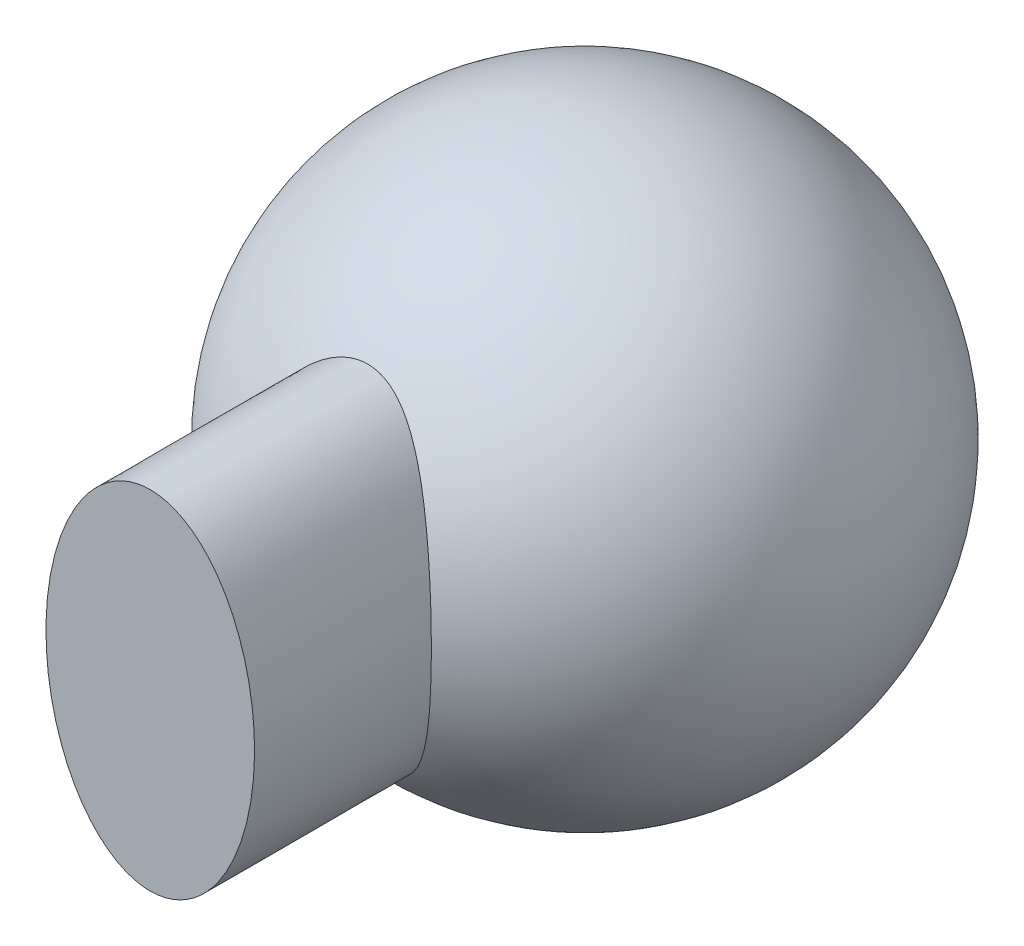
ISO-10303-21;
HEADER;
FILE_DESCRIPTION(('STEP AP214'),'2;1');
FILE_NAME('part.step','',(''),(''),'','','');
FILE_SCHEMA(('AUTOMOTIVE_DESIGN { 1 0 10303 214 1 1 1 1 }'));
ENDSEC;
DATA;
#1=APPLICATION_CONTEXT('core data for automotive mechanical design processes');
#2=APPLICATION_PROTOCOL_DEFINITION('international standard','automotive_design',2000,#1);
#3=PRODUCT_CONTEXT('',#1,'mechanical');
#4=PRODUCT('Part','Part','',(#3));
#5=PRODUCT_RELATED_PRODUCT_CATEGORY('part','',(#4));
#6=PRODUCT_DEFINITION_FORMATION('','',#4);
#7=PRODUCT_DEFINITION_CONTEXT('part definition',#1,'design');
#8=PRODUCT_DEFINITION('design','',#6,#7);
#9=PRODUCT_DEFINITION_SHAPE('','',#8);
#10=(LENGTH_UNIT() NAMED_UNIT(*) SI_UNIT(.MILLI.,.METRE.));
#11=(NAMED_UNIT(*) PLANE_ANGLE_UNIT() SI_UNIT($,.RADIAN.));
#12=(NAMED_UNIT(*) SI_UNIT($,.STERADIAN.) SOLID_ANGLE_UNIT());
#13=UNCERTAINTY_MEASURE_WITH_UNIT(LENGTH_MEASURE(1.E-05),#10,'distance_accuracy_value','');
#14=(GEOMETRIC_REPRESENTATION_CONTEXT(3) GLOBAL_UNCERTAINTY_ASSIGNED_CONTEXT((#13)) GLOBAL_UNIT_ASSIGNED_CONTEXT((#10,
#11,#12)) REPRESENTATION_CONTEXT('',''));
#15=CARTESIAN_POINT('',(0.,0.,0.));
#16=DIRECTION('',(0.,0.,1.));
#17=DIRECTION('',(1.,0.,0.));
#18=AXIS2_PLACEMENT_3D('',#15,#16,#17);
#19=CARTESIAN_POINT('',(0.,0.,19.84375));
#20=DIRECTION('',(0.,0.,1.));
#21=DIRECTION('',(0.,-1.,0.));
#22=AXIS2_PLACEMENT_3D('',#19,#20,#21);
#23=ELLIPSE('',#22,7.9375,4.7625);
#24=DIRECTION('',(0.,0.,-1.));
#25=VECTOR('',#24,1.);
#26=SURFACE_OF_LINEAR_EXTRUSION('',#23,#25);
#27=CARTESIAN_POINT('',(0.,-7.9375,9.91393432245746));
#28=CARTESIAN_POINT('',(-0.0788271013535129,-7.93749939305309,9.91393473412998));
#29=CARTESIAN_POINT('',(-0.157660724959963,-7.93423018182998,9.91561130271447));
#30=CARTESIAN_POINT('',(-0.314684303138368,-7.92123813340423,9.92225689652768));
#31=CARTESIAN_POINT('',(-0.392873930252473,-7.91151219622446,9.92722750327466));
#32=CARTESIAN_POINT('',(-0.547108536920799,-7.88599628406234,9.94021217946963));
#33=CARTESIAN_POINT('',(-0.623167628856981,-7.87027392914492,9.94819230055361));
#34=CARTESIAN_POINT('',(-0.773542638782759,-7.83312498063421,9.9669392108722));
#35=CARTESIAN_POINT('',(-0.847857833356806,-7.81169606378065,9.97770713502977));
#36=CARTESIAN_POINT('',(-1.06783476654783,-7.7394133760856,10.0137717045932));
#37=CARTESIAN_POINT('',(-1.21030495094333,-7.68060248221051,10.0428089036473));
#38=CARTESIAN_POINT('',(-1.54726343172525,-7.51494937796682,10.1229055755407));
#39=CARTESIAN_POINT('',(-1.73598879628897,-7.3984237735311,10.1779773553932));
#40=CARTESIAN_POINT('',(-2.00212622143167,-7.20384219448494,10.2664116642236));
#41=CARTESIAN_POINT('',(-2.08810391167954,-7.13559163498631,10.2968998346285));
#42=CARTESIAN_POINT('',(-2.25468831540992,-6.99335625747456,10.3591643388172));
#43=CARTESIAN_POINT('',(-2.33529603089741,-6.91937251484369,10.3909404304928));
#44=CARTESIAN_POINT('',(-2.53682775972689,-6.72194870099306,10.4738903499377));
#45=CARTESIAN_POINT('',(-2.65389862842513,-6.59479433997214,10.5255859097498));
#46=CARTESIAN_POINT('',(-2.87605598622511,-6.33076464307304,10.6288350686593));
#47=CARTESIAN_POINT('',(-2.98115652503119,-6.19390101589774,10.6803887634089));
#48=CARTESIAN_POINT('',(-3.20947387279228,-5.87110442708068,10.7969122412572));
#49=CARTESIAN_POINT('',(-3.32909047084653,-5.68246219145526,10.8614312611221));
#50=CARTESIAN_POINT('',(-3.55197522256664,-5.29435174576013,10.9862343068103));
#51=CARTESIAN_POINT('',(-3.65523271291553,-5.09487658729803,11.0465155562159));
#52=CARTESIAN_POINT('',(-3.84642079359177,-4.68759352859872,11.1613315539746));
#53=CARTESIAN_POINT('',(-3.93437703061895,-4.47980030396229,11.2158758562339));
#54=CARTESIAN_POINT('',(-4.09608842507793,-4.05725122448623,11.3183287173818));
#55=CARTESIAN_POINT('',(-4.16984657411839,-3.84249684756313,11.3662386735621));
#56=CARTESIAN_POINT('',(-4.30383825680392,-3.40746299814802,11.4546891698553));
#57=CARTESIAN_POINT('',(-4.36407851621658,-3.18718633416882,11.4952333728463));
#58=CARTESIAN_POINT('',(-4.4715804749601,-2.74220261492957,11.568449699945));
#59=CARTESIAN_POINT('',(-4.51884162917925,-2.51749537401362,11.6011214934111));
#60=CARTESIAN_POINT('',(-4.60071912447829,-2.06484896308331,11.658193458756));
#61=CARTESIAN_POINT('',(-4.63534033569729,-1.83691107307013,11.6825968161818));
#62=CARTESIAN_POINT('',(-4.69220851621079,-1.37870076429045,11.7228870055865));
#63=CARTESIAN_POINT('',(-4.71445263435496,-1.14842782005662,11.7387718752415));
#64=CARTESIAN_POINT('',(-4.74669587519764,-0.68664247924534,11.7618490927025));
#65=CARTESIAN_POINT('',(-4.75669750975929,-0.455130346713433,11.7690432236351));
#66=CARTESIAN_POINT('',(-4.76452710492962,0.00820617764960818,11.7746722992924));
#67=CARTESIAN_POINT('',(-4.7623550323927,0.240030570329222,11.7731072201681));
#68=CARTESIAN_POINT('',(-4.74582247971294,0.703051549770778,11.7612327220086));
#69=CARTESIAN_POINT('',(-4.73146039444439,0.934248049832531,11.7509221514068));
#70=CARTESIAN_POINT('',(-4.69045898457885,1.39495079661604,11.7216633038144));
#71=CARTESIAN_POINT('',(-4.66382238842379,1.6244574074624,11.7027169464415));
#72=CARTESIAN_POINT('',(-4.59808809922057,2.08088375269606,11.6563810885626));
#73=CARTESIAN_POINT('',(-4.55898723257359,2.30780281299469,11.6289894378106));
#74=CARTESIAN_POINT('',(-4.46804978724304,2.75793932931822,11.5660716569667));
#75=CARTESIAN_POINT('',(-4.41621318762835,2.98115677925889,11.5305455135058));
#76=CARTESIAN_POINT('',(-4.29938442369564,3.42283140560263,11.4517801654059));
#77=CARTESIAN_POINT('',(-4.23438776119521,3.64128692599557,11.4085383241005));
#78=CARTESIAN_POINT('',(-4.09068888384063,4.07210760243689,11.3149438849024));
#79=CARTESIAN_POINT('',(-4.01198636248485,4.28447262216079,11.2645911279944));
#80=CARTESIAN_POINT('',(-3.84004392378339,4.70182024355113,11.1575443848452));
#81=CARTESIAN_POINT('',(-3.74679226086621,4.90679671437375,11.1008452857238));
#82=CARTESIAN_POINT('',(-3.54474437414306,5.30745238800261,10.9822389366736));
#83=CARTESIAN_POINT('',(-3.43594757779432,5.5031312480147,10.9203314949509));
#84=CARTESIAN_POINT('',(-3.2251363223459,5.84449215961342,10.8057724475526));
#85=CARTESIAN_POINT('',(-3.12619012276718,5.99228990922115,10.7537767880283));
#86=CARTESIAN_POINT('',(-2.91670302100292,6.2788446322726,10.648622600598));
#87=CARTESIAN_POINT('',(-2.80617337043878,6.41761017058406,10.5954652401279));
#88=CARTESIAN_POINT('',(-2.59902944772443,6.65382287687148,10.5015294782161));
#89=CARTESIAN_POINT('',(-2.50497225563098,6.75348665321523,10.46068681265));
#90=CARTESIAN_POINT('',(-2.30853260265671,6.94523551299954,10.3800229167656));
#91=CARTESIAN_POINT('',(-2.20613350665162,7.03730467789853,10.3402039465814));
#92=CARTESIAN_POINT('',(-2.01414727692478,7.19445031512042,10.2706476375617));
#93=CARTESIAN_POINT('',(-1.92611315736618,7.26123573921094,10.2404907781185));
#94=CARTESIAN_POINT('',(-1.74433271355236,7.38775475576258,10.1824106952534));
#95=CARTESIAN_POINT('',(-1.65058464815131,7.44748618228666,10.1544881587267));
#96=CARTESIAN_POINT('',(-1.45762344605667,7.55850035437991,10.1018543187044));
#97=CARTESIAN_POINT('',(-1.3584232524695,7.60980204605636,10.0771358411553));
#98=CARTESIAN_POINT('',(-1.15467540991781,7.70268016638467,10.0318726783303));
#99=CARTESIAN_POINT('',(-1.05013167403783,7.74426359083064,10.0113249920771));
#100=CARTESIAN_POINT('',(-0.873510960910133,7.80374878403274,9.9816856019121));
#101=CARTESIAN_POINT('',(-0.802755908899298,7.82486108376775,9.97109279035284));
#102=CARTESIAN_POINT('',(-0.659591420435303,7.86193142273762,9.95241295415753));
#103=CARTESIAN_POINT('',(-0.587182481045582,7.87789098931923,9.94432518701802));
#104=CARTESIAN_POINT('',(-0.441177975160888,7.90431592017841,9.9308960656105));
#105=CARTESIAN_POINT('',(-0.367583489791073,7.91478602714362,9.92555234067518));
#106=CARTESIAN_POINT('',(-0.219646920935581,7.93001556032705,9.9177695359867));
#107=CARTESIAN_POINT('',(-0.145304817755563,7.93477483570656,9.91533053295522));
#108=CARTESIAN_POINT('',(0.00373528103012565,7.93847161993563,9.91343657582343));
#109=CARTESIAN_POINT('',(0.0784337020846186,7.93739563875154,9.91398853627497));
#110=CARTESIAN_POINT('',(0.2274325539093,7.9294172836682,9.91807372464476));
#111=CARTESIAN_POINT('',(0.301732992673467,7.92251502724204,9.92160689245399));
#112=CARTESIAN_POINT('',(0.449432285789927,7.90304233756981,9.93154109014083));
#113=CARTESIAN_POINT('',(0.52283060012773,7.89046866439472,9.93794375927459));
#114=CARTESIAN_POINT('',(0.668215064680717,7.8599312622595,9.95341899898057));
#115=CARTESIAN_POINT('',(0.740200908612164,7.84196637772042,9.96249214194737));
#116=CARTESIAN_POINT('',(0.898463295831819,7.79636521620292,9.98538112822599));
#117=CARTESIAN_POINT('',(0.984287997039687,7.76746037331058,9.99980556964539));
#118=CARTESIAN_POINT('',(1.15271268481484,7.70283850793288,10.0317465574185));
#119=CARTESIAN_POINT('',(1.23531192969671,7.66711992963,10.0492638099026));
#120=CARTESIAN_POINT('',(1.47808335787528,7.55076053678616,10.1056851331913));
#121=CARTESIAN_POINT('',(1.63305014258907,7.46097030104384,10.1484308568614));
#122=CARTESIAN_POINT('',(1.89162401924568,7.28726987072631,10.2287154587594));
#123=CARTESIAN_POINT('',(1.9984626126685,7.2073852788682,10.2649325703333));
#124=CARTESIAN_POINT('',(2.20421134365836,7.03877956584885,10.3395407016619));
#125=CARTESIAN_POINT('',(2.3031170079644,6.95005352147741,10.3779329274003));
#126=CARTESIAN_POINT('',(2.49342108488979,6.76519016254414,10.4558212483157));
#127=CARTESIAN_POINT('',(2.58481164125012,6.66904529082397,10.4953184422543));
#128=CARTESIAN_POINT('',(2.76043182478113,6.47058912111415,10.5745268304224));
#129=CARTESIAN_POINT('',(2.84466311884697,6.36827926805344,10.6142379725359));
#130=CARTESIAN_POINT('',(3.05295092242441,6.09803786949131,10.7159139772374));
#131=CARTESIAN_POINT('',(3.17208392887683,5.92617636083623,10.7775558916957));
#132=CARTESIAN_POINT('',(3.39514513279735,5.57226888687692,10.8977124882492));
#133=CARTESIAN_POINT('',(3.49909260619557,5.39023624564572,10.9562310739938));
#134=CARTESIAN_POINT('',(3.69307052646564,5.0178821819833,11.0688423727738));
#135=CARTESIAN_POINT('',(3.78311559708366,4.8275697429046,11.1229397078688));
#136=CARTESIAN_POINT('',(3.95034413099329,4.43994005594057,11.2258155767223));
#137=CARTESIAN_POINT('',(4.0275237116374,4.24262071517225,11.274592503317));
#138=CARTESIAN_POINT('',(4.16962007068551,3.84242357587747,11.3660544099245));
#139=CARTESIAN_POINT('',(4.23454577710108,3.63954994849931,11.408743819635));
#140=CARTESIAN_POINT('',(4.35270650387042,3.2292044395069,11.487529052159));
#141=CARTESIAN_POINT('',(4.40594259313807,3.02173298023604,11.5236254777928));
#142=CARTESIAN_POINT('',(4.5010916347226,2.60320313486951,11.5888134886555));
#143=CARTESIAN_POINT('',(4.54300853668094,2.39214602732019,11.6179075168679));
#144=CARTESIAN_POINT('',(4.61581546214788,1.96725249091747,11.6688180480529));
#145=CARTESIAN_POINT('',(4.64670296470262,1.75341543822179,11.6906328871704));
#146=CARTESIAN_POINT('',(4.72308196130013,1.10918093827294,11.7448000821613));
#147=CARTESIAN_POINT('',(4.75235584004921,0.675765380653234,11.7659213436404));
#148=CARTESIAN_POINT('',(4.76822477404279,-0.192231597991191,11.7773311897605));
#149=CARTESIAN_POINT('',(4.75482081401513,-0.626812991884798,11.7676204858034));
#150=CARTESIAN_POINT('',(4.70251382892573,-1.27460140129378,11.7302581066043));
#151=CARTESIAN_POINT('',(4.67969928324044,-1.48991622506651,11.7139960329266));
#152=CARTESIAN_POINT('',(4.62318391904588,-1.91840248925205,11.6740292723805));
#153=CARTESIAN_POINT('',(4.58948530638791,-2.13157435495483,11.6503260936127));
#154=CARTESIAN_POINT('',(4.51098828956948,-2.55499194675845,11.5956945688432));
#155=CARTESIAN_POINT('',(4.46618659445648,-2.76523678573965,11.5647640808234));
#156=CARTESIAN_POINT('',(4.36519541170912,-3.18182524827514,11.4960066137004));
#157=CARTESIAN_POINT('',(4.3090065471192,-3.38816908459621,11.4581800119268));
#158=CARTESIAN_POINT('',(4.18481693137413,-3.79603189145863,11.376053477634));
#159=CARTESIAN_POINT('',(4.11681291569148,-3.99754951095989,11.3317517565771));
#160=CARTESIAN_POINT('',(3.96843593536461,-4.39463865874599,11.2372519596207));
#161=CARTESIAN_POINT('',(3.88805989958492,-4.5902086961737,11.1870524204265));
#162=CARTESIAN_POINT('',(3.71411953543524,-4.97426446671298,11.0814841507833));
#163=CARTESIAN_POINT('',(3.62054000591635,-5.16274171256244,11.0261094873916));
#164=CARTESIAN_POINT('',(3.4193678285946,-5.53062625845837,10.9113374739277));
#165=CARTESIAN_POINT('',(3.31178725193776,-5.71004118880905,10.8519436099851));
#166=CARTESIAN_POINT('',(3.10272028599408,-6.02553563285262,10.7418506848741));
#167=CARTESIAN_POINT('',(3.00381302755762,-6.16347484031843,10.6915855448858));
#168=CARTESIAN_POINT('',(2.79472876844718,-6.43089539275603,10.5903023310013));
#169=CARTESIAN_POINT('',(2.68452595974259,-6.56035620921533,10.539282771506));
#170=CARTESIAN_POINT('',(2.47765979633789,-6.78114004629618,10.4492338759317));
#171=CARTESIAN_POINT('',(2.38334481697012,-6.87459111738265,10.4100340149744));
#172=CARTESIAN_POINT('',(2.1868752381433,-7.05366888934383,10.3330771753189));
#173=CARTESIAN_POINT('',(2.08471733785494,-7.13929226221453,10.295320814268));
#174=CARTESIAN_POINT('',(1.87247012389397,-7.30084206164991,10.2225540339478));
#175=CARTESIAN_POINT('',(1.76240231792409,-7.37679333501954,10.1875366716175));
#176=CARTESIAN_POINT('',(1.53409949402204,-7.5171559200626,10.1216570932574));
#177=CARTESIAN_POINT('',(1.41587329442671,-7.5815794294392,10.0907904939415));
#178=CARTESIAN_POINT('',(1.15389482697123,-7.70478192184181,10.0309345464692));
#179=CARTESIAN_POINT('',(1.008905172538,-7.76145027967409,10.002838637881));
#180=CARTESIAN_POINT('',(0.785417326837084,-7.82983510148617,9.96860120204786));
#181=CARTESIAN_POINT('',(0.709991151281373,-7.84984989705843,9.95851197743692));
#182=CARTESIAN_POINT('',(0.557495590738796,-7.88396916067142,9.94124719781036));
#183=CARTESIAN_POINT('',(0.480426989486065,-7.89807638414593,9.93407028447118));
#184=CARTESIAN_POINT('',(0.336217907609483,-7.91847940692688,9.9236681997726));
#185=CARTESIAN_POINT('',(0.269222944917659,-7.92560038349327,9.92002638859698));
#186=CARTESIAN_POINT('',(0.134820194739467,-7.9351105209261,9.91515948772117));
#187=CARTESIAN_POINT('',(0.0674124824179741,-7.9375005190575,9.9139339703975));
#188=CARTESIAN_POINT('',(0.,-7.9375,9.91393432245746));
#189=B_SPLINE_CURVE_WITH_KNOTS('',3,(#27,#28,#29,#30,#31,#32,#33,#34,#35,#36,#37,#38,#39,#40,
#41,#42,#43,#44,#45,#46,#47,#48,#49,#50,#51,#52,#53,#54,#55,#56,#57,#58,#59,#60,#61,#62,#63,#64,
#65,#66,#67,#68,#69,#70,#71,#72,#73,#74,#75,#76,#77,#78,#79,#80,#81,#82,#83,#84,#85,#86,#87,#88,
#89,#90,#91,#92,#93,#94,#95,#96,#97,#98,#99,#100,#101,#102,#103,#104,#105,#106,#107,#108,#109,
#110,#111,#112,#113,#114,#115,#116,#117,#118,#119,#120,#121,#122,#123,#124,#125,#126,#127,#128,
#129,#130,#131,#132,#133,#134,#135,#136,#137,#138,#139,#140,#141,#142,#143,#144,#145,#146,#147,
#148,#149,#150,#151,#152,#153,#154,#155,#156,#157,#158,#159,#160,#161,#162,#163,#164,#165,#166,
#167,#168,#169,#170,#171,#172,#173,#174,#175,#176,#177,#178,#179,#180,#181,#182,#183,#184,#185,
#186,#187,#188),.UNSPECIFIED.,.T.,.F.,(4,2,2,2,2,2,2,2,2,2,2,2,2,2,2,2,2,2,2,2,2,2,2,2,2,2,2,2,
2,2,2,2,2,2,2,2,2,2,2,2,2,2,2,2,2,2,2,2,2,2,2,2,2,2,2,2,2,2,2,2,2,2,2,2,2,2,2,2,2,2,2,2,2,2,2,2,
2,2,2,2,4),(0.,0.236408292949557,0.472930171458575,0.706860150158566,0.940885512612896,
1.40960935668978,2.09121724821472,2.43281871995445,2.77435627134047,3.31475456819388,
3.85451191104948,4.55098737506331,5.24791496955979,5.94366293460601,6.63926414120026,
7.33451848324175,8.02980202092719,8.72481738414232,9.41999278281692,10.1150255243004,
10.8100601581648,11.5051863252455,12.2001580505575,12.8953068681017,13.590456828127,
14.2858447965973,14.9812483178993,15.6772161737714,16.3732096694445,16.9286321936733,
17.4835201210938,17.9121370581712,18.3416306949666,18.684929676914,19.0283337965878,
19.3709552227192,19.713329244339,19.9369004730088,20.1604053708699,20.3837168493362,
20.6070342259406,20.8308680907608,21.0546974426065,21.2786548244533,21.5026602447641,
21.7773496473629,22.0521018465363,22.6021667151498,23.0163661274468,23.4307974822097,
23.8456567149175,24.260419089592,24.913480868568,25.5657063356526,26.2172409916729,
26.8689719182986,27.520226153641,28.1714208126223,28.8223879536241,29.473503788968,
30.7748250467374,32.0761162786662,32.7271647762612,33.3780814099138,34.0291912064221,
34.6802653873314,35.3315197470206,35.9829360305882,36.6351085023318,37.2867223763443,
37.817313079305,38.3491443045308,38.7640756011086,39.1791824962761,39.5932005294911,
40.0067778594708,40.4792568780831,40.7150737486456,40.9507805057045,41.152991303736,
41.3551663123089),.UNSPECIFIED.);
#190=CARTESIAN_POINT('',(0.,-7.9375,9.91393432245746));
#191=VERTEX_POINT('',#190);
#192=EDGE_CURVE('E12',#191,#191,#189,.T.);
#193=ORIENTED_EDGE('',*,*,#192,.F.);
#194=EDGE_LOOP('',(#193));
#195=FACE_BOUND('',#194,.T.);
#196=CARTESIAN_POINT('',(0.,-7.9375,19.84375));
#197=VERTEX_POINT('',#196);
#198=EDGE_CURVE('E55',#197,#197,#23,.T.);
#199=ORIENTED_EDGE('',*,*,#198,.F.);
#200=EDGE_LOOP('',(#199));
#201=FACE_BOUND('',#200,.T.);
#202=ADVANCED_FACE('F45',(#195,#201),#26,.F.);
#203=CARTESIAN_POINT('',(0.,0.,19.84375));
#204=DIRECTION('',(0.,0.,1.));
#205=DIRECTION('',(1.,0.,0.));
#206=AXIS2_PLACEMENT_3D('',#203,#204,#205);
#207=PLANE('',#206);
#208=ORIENTED_EDGE('',*,*,#198,.T.);
#209=EDGE_LOOP('',(#208));
#210=FACE_BOUND('',#209,.T.);
#211=ADVANCED_FACE('F65',(#210),#207,.T.);
#212=CARTESIAN_POINT('',(0.,0.,0.));
#213=DIRECTION('',(0.,1.,0.));
#214=DIRECTION('',(1.,0.,0.));
#215=AXIS2_PLACEMENT_3D('',#212,#213,#214);
#216=SPHERICAL_SURFACE('',#215,12.7);
#217=ORIENTED_EDGE('',*,*,#192,.T.);
#218=EDGE_LOOP('',(#217));
#219=FACE_BOUND('',#218,.T.);
#220=ADVANCED_FACE('F47',(#219),#216,.T.);
#221=CLOSED_SHELL('',(#202,#211,#220));
#222=MANIFOLD_SOLID_BREP('B2',#221);
#223=ADVANCED_BREP_SHAPE_REPRESENTATION('',(#18,#222),#14);
#224=SHAPE_DEFINITION_REPRESENTATION(#9,#223);
ENDSEC;
END-ISO-10303-21;
